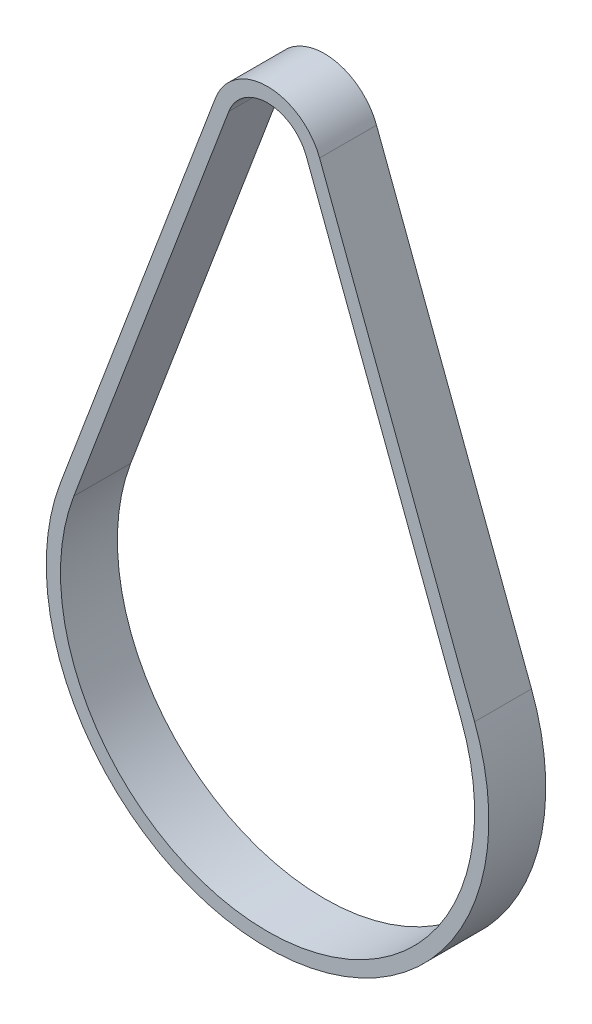
ISO-10303-21;
HEADER;
FILE_DESCRIPTION(('STEP AP214'),'2;1');
FILE_NAME('part.step','',(''),(''),'','','');
FILE_SCHEMA(('AUTOMOTIVE_DESIGN { 1 0 10303 214 1 1 1 1 }'));
ENDSEC;
DATA;
#1=APPLICATION_CONTEXT('core data for automotive mechanical design processes');
#2=APPLICATION_PROTOCOL_DEFINITION('international standard','automotive_design',2000,#1);
#3=PRODUCT_CONTEXT('',#1,'mechanical');
#4=PRODUCT('Part','Part','',(#3));
#5=PRODUCT_RELATED_PRODUCT_CATEGORY('part','',(#4));
#6=PRODUCT_DEFINITION_FORMATION('','',#4);
#7=PRODUCT_DEFINITION_CONTEXT('part definition',#1,'design');
#8=PRODUCT_DEFINITION('design','',#6,#7);
#9=PRODUCT_DEFINITION_SHAPE('','',#8);
#10=(LENGTH_UNIT() NAMED_UNIT(*) SI_UNIT(.MILLI.,.METRE.));
#11=(NAMED_UNIT(*) PLANE_ANGLE_UNIT() SI_UNIT($,.RADIAN.));
#12=(NAMED_UNIT(*) SI_UNIT($,.STERADIAN.) SOLID_ANGLE_UNIT());
#13=UNCERTAINTY_MEASURE_WITH_UNIT(LENGTH_MEASURE(1.E-05),#10,'distance_accuracy_value','');
#14=(GEOMETRIC_REPRESENTATION_CONTEXT(3) GLOBAL_UNCERTAINTY_ASSIGNED_CONTEXT((#13)) GLOBAL_UNIT_ASSIGNED_CONTEXT((#10,
#11,#12)) REPRESENTATION_CONTEXT('',''));
#15=CARTESIAN_POINT('',(0.,0.,0.));
#16=DIRECTION('',(0.,0.,1.));
#17=DIRECTION('',(1.,0.,0.));
#18=AXIS2_PLACEMENT_3D('',#15,#16,#17);
#19=CARTESIAN_POINT('',(0.,26.8063948233017,8.));
#20=DIRECTION('',(0.,0.,1.));
#21=DIRECTION('',(1.,0.,0.));
#22=AXIS2_PLACEMENT_3D('',#19,#20,#21);
#23=PLANE('',#22);
#24=CARTESIAN_POINT('',(0.,26.8063948233017,8.));
#25=DIRECTION('',(0.,0.,1.));
#26=DIRECTION('',(1.,0.,0.));
#27=AXIS2_PLACEMENT_3D('',#24,#25,#26);
#28=CIRCLE('',#27,7.81999999999999);
#29=CARTESIAN_POINT('',(7.31628348817592,29.5676256938818,8.));
#30=VERTEX_POINT('',#29);
#31=CARTESIAN_POINT('',(-7.31628348817593,29.5676256938818,8.));
#32=VERTEX_POINT('',#31);
#33=EDGE_CURVE('E133',#30,#32,#28,.T.);
#34=ORIENTED_EDGE('',*,*,#33,.T.);
#35=DIRECTION('',(-0.353098576800516,-0.935586123807664,0.));
#36=VECTOR('',#35,1.);
#37=CARTESIAN_POINT('',(-7.31628348817593,29.5676256938818,8.));
#38=LINE('',#37,#36);
#39=CARTESIAN_POINT('',(-29.1014063810374,-28.1552313866797,8.));
#40=VERTEX_POINT('',#39);
#41=EDGE_CURVE('E136',#32,#40,#38,.T.);
#42=ORIENTED_EDGE('',*,*,#41,.T.);
#43=CARTESIAN_POINT('',(0.,-39.1383626180598,8.));
#44=DIRECTION('',(0.,0.,1.));
#45=DIRECTION('',(1.,0.,0.));
#46=AXIS2_PLACEMENT_3D('',#43,#44,#45);
#47=CIRCLE('',#46,31.105);
#48=CARTESIAN_POINT('',(29.1014063810374,-28.1552313866797,8.));
#49=VERTEX_POINT('',#48);
#50=EDGE_CURVE('E139',#40,#49,#47,.T.);
#51=ORIENTED_EDGE('',*,*,#50,.T.);
#52=DIRECTION('',(-0.353098576800516,0.935586123807664,0.));
#53=VECTOR('',#52,1.);
#54=CARTESIAN_POINT('',(7.31628348817592,29.5676256938818,8.));
#55=LINE('',#54,#53);
#56=EDGE_CURVE('E141',#49,#30,#55,.T.);
#57=ORIENTED_EDGE('',*,*,#56,.T.);
#58=EDGE_LOOP('',(#34,#42,#51,#57));
#59=FACE_BOUND('',#58,.T.);
#60=DIRECTION('',(-0.353098576800516,0.935586123807664,0.));
#61=VECTOR('',#60,1.);
#62=CARTESIAN_POINT('',(5.4451112405606,28.8614285402807,8.));
#63=LINE('',#62,#61);
#64=CARTESIAN_POINT('',(27.2302341334221,-28.8614285402807,8.));
#65=VERTEX_POINT('',#64);
#66=CARTESIAN_POINT('',(5.4451112405606,28.8614285402807,8.));
#67=VERTEX_POINT('',#66);
#68=EDGE_CURVE('E105',#65,#67,#63,.T.);
#69=ORIENTED_EDGE('',*,*,#68,.F.);
#70=CARTESIAN_POINT('',(0.,-39.1383626180598,8.));
#71=DIRECTION('',(0.,0.,1.));
#72=DIRECTION('',(1.,0.,0.));
#73=AXIS2_PLACEMENT_3D('',#70,#71,#72);
#74=CIRCLE('',#73,29.105);
#75=CARTESIAN_POINT('',(-27.2302341334221,-28.8614285402807,8.));
#76=VERTEX_POINT('',#75);
#77=EDGE_CURVE('E97',#76,#65,#74,.T.);
#78=ORIENTED_EDGE('',*,*,#77,.F.);
#79=DIRECTION('',(-0.353098576800516,-0.935586123807664,0.));
#80=VECTOR('',#79,1.);
#81=CARTESIAN_POINT('',(-5.44511124056061,28.8614285402807,8.));
#82=LINE('',#81,#80);
#83=CARTESIAN_POINT('',(-5.44511124056061,28.8614285402807,8.));
#84=VERTEX_POINT('',#83);
#85=EDGE_CURVE('E119',#84,#76,#82,.T.);
#86=ORIENTED_EDGE('',*,*,#85,.F.);
#87=CARTESIAN_POINT('',(0.,26.8063948233017,8.));
#88=DIRECTION('',(0.,0.,1.));
#89=DIRECTION('',(1.,0.,0.));
#90=AXIS2_PLACEMENT_3D('',#87,#88,#89);
#91=CIRCLE('',#90,5.81999999999999);
#92=EDGE_CURVE('E117',#67,#84,#91,.T.);
#93=ORIENTED_EDGE('',*,*,#92,.F.);
#94=EDGE_LOOP('',(#69,#78,#86,#93));
#95=FACE_BOUND('',#94,.T.);
#96=ADVANCED_FACE('F32',(#59,#95),#23,.T.);
#97=CARTESIAN_POINT('',(0.,26.8063948233017,0.));
#98=DIRECTION('',(0.,0.,1.));
#99=DIRECTION('',(1.,0.,0.));
#100=AXIS2_PLACEMENT_3D('',#97,#98,#99);
#101=PLANE('',#100);
#102=CARTESIAN_POINT('',(0.,26.8063948233017,0.));
#103=DIRECTION('',(0.,0.,1.));
#104=DIRECTION('',(1.,0.,0.));
#105=AXIS2_PLACEMENT_3D('',#102,#103,#104);
#106=CIRCLE('',#105,7.81999999999999);
#107=CARTESIAN_POINT('',(7.31628348817592,29.5676256938818,0.));
#108=VERTEX_POINT('',#107);
#109=CARTESIAN_POINT('',(-7.31628348817593,29.5676256938818,0.));
#110=VERTEX_POINT('',#109);
#111=EDGE_CURVE('E113',#108,#110,#106,.T.);
#112=ORIENTED_EDGE('',*,*,#111,.F.);
#113=DIRECTION('',(-0.353098576800516,0.935586123807664,0.));
#114=VECTOR('',#113,1.);
#115=CARTESIAN_POINT('',(7.31628348817592,29.5676256938818,0.));
#116=LINE('',#115,#114);
#117=CARTESIAN_POINT('',(29.1014063810374,-28.1552313866797,0.));
#118=VERTEX_POINT('',#117);
#119=EDGE_CURVE('E137',#118,#108,#116,.T.);
#120=ORIENTED_EDGE('',*,*,#119,.F.);
#121=CARTESIAN_POINT('',(0.,-39.1383626180598,0.));
#122=DIRECTION('',(0.,0.,1.));
#123=DIRECTION('',(1.,0.,0.));
#124=AXIS2_PLACEMENT_3D('',#121,#122,#123);
#125=CIRCLE('',#124,31.105);
#126=CARTESIAN_POINT('',(-29.1014063810374,-28.1552313866797,0.));
#127=VERTEX_POINT('',#126);
#128=EDGE_CURVE('E148',#127,#118,#125,.T.);
#129=ORIENTED_EDGE('',*,*,#128,.F.);
#130=DIRECTION('',(-0.353098576800516,-0.935586123807664,0.));
#131=VECTOR('',#130,1.);
#132=CARTESIAN_POINT('',(-7.31628348817593,29.5676256938818,0.));
#133=LINE('',#132,#131);
#134=EDGE_CURVE('E146',#110,#127,#133,.T.);
#135=ORIENTED_EDGE('',*,*,#134,.F.);
#136=EDGE_LOOP('',(#112,#120,#129,#135));
#137=FACE_BOUND('',#136,.T.);
#138=CARTESIAN_POINT('',(0.,-39.1383626180598,0.));
#139=DIRECTION('',(0.,0.,1.));
#140=DIRECTION('',(1.,0.,0.));
#141=AXIS2_PLACEMENT_3D('',#138,#139,#140);
#142=CIRCLE('',#141,29.105);
#143=CARTESIAN_POINT('',(-27.2302341334221,-28.8614285402807,0.));
#144=VERTEX_POINT('',#143);
#145=CARTESIAN_POINT('',(27.2302341334221,-28.8614285402807,0.));
#146=VERTEX_POINT('',#145);
#147=EDGE_CURVE('E55',#144,#146,#142,.T.);
#148=ORIENTED_EDGE('',*,*,#147,.T.);
#149=DIRECTION('',(-0.353098576800516,0.935586123807664,0.));
#150=VECTOR('',#149,1.);
#151=CARTESIAN_POINT('',(5.4451112405606,28.8614285402807,0.));
#152=LINE('',#151,#150);
#153=CARTESIAN_POINT('',(5.4451112405606,28.8614285402807,0.));
#154=VERTEX_POINT('',#153);
#155=EDGE_CURVE('E112',#146,#154,#152,.T.);
#156=ORIENTED_EDGE('',*,*,#155,.T.);
#157=CARTESIAN_POINT('',(0.,26.8063948233017,0.));
#158=DIRECTION('',(0.,0.,1.));
#159=DIRECTION('',(1.,0.,0.));
#160=AXIS2_PLACEMENT_3D('',#157,#158,#159);
#161=CIRCLE('',#160,5.81999999999999);
#162=CARTESIAN_POINT('',(-5.44511124056061,28.8614285402807,0.));
#163=VERTEX_POINT('',#162);
#164=EDGE_CURVE('E125',#154,#163,#161,.T.);
#165=ORIENTED_EDGE('',*,*,#164,.T.);
#166=DIRECTION('',(-0.353098576800516,-0.935586123807664,0.));
#167=VECTOR('',#166,1.);
#168=CARTESIAN_POINT('',(-5.44511124056061,28.8614285402807,0.));
#169=LINE('',#168,#167);
#170=EDGE_CURVE('E106',#163,#144,#169,.T.);
#171=ORIENTED_EDGE('',*,*,#170,.T.);
#172=EDGE_LOOP('',(#148,#156,#165,#171));
#173=FACE_BOUND('',#172,.T.);
#174=ADVANCED_FACE('F166',(#137,#173),#101,.F.);
#175=CARTESIAN_POINT('',(0.,26.8063948233017,8.));
#176=DIRECTION('',(0.,0.,-1.));
#177=DIRECTION('',(-1.,0.,0.));
#178=AXIS2_PLACEMENT_3D('',#175,#176,#177);
#179=CYLINDRICAL_SURFACE('',#178,7.81999999999999);
#180=ORIENTED_EDGE('',*,*,#111,.T.);
#181=DIRECTION('',(0.,0.,-1.));
#182=VECTOR('',#181,1.);
#183=CARTESIAN_POINT('',(-7.31628348817593,29.5676256938818,8.));
#184=LINE('',#183,#182);
#185=EDGE_CURVE('E11',#32,#110,#184,.T.);
#186=ORIENTED_EDGE('',*,*,#185,.F.);
#187=ORIENTED_EDGE('',*,*,#33,.F.);
#188=DIRECTION('',(0.,0.,-1.));
#189=VECTOR('',#188,1.);
#190=CARTESIAN_POINT('',(7.31628348817592,29.5676256938818,8.));
#191=LINE('',#190,#189);
#192=EDGE_CURVE('E143',#30,#108,#191,.T.);
#193=ORIENTED_EDGE('',*,*,#192,.T.);
#194=EDGE_LOOP('',(#180,#186,#187,#193));
#195=FACE_BOUND('',#194,.T.);
#196=ADVANCED_FACE('F34',(#195),#179,.T.);
#197=CARTESIAN_POINT('',(-7.31628348817593,29.5676256938818,8.));
#198=DIRECTION('',(0.935586123807664,-0.353098576800517,0.));
#199=DIRECTION('',(0.353098576800517,0.935586123807664,0.));
#200=AXIS2_PLACEMENT_3D('',#197,#198,#199);
#201=PLANE('',#200);
#202=ORIENTED_EDGE('',*,*,#134,.T.);
#203=DIRECTION('',(0.,0.,-1.));
#204=VECTOR('',#203,1.);
#205=CARTESIAN_POINT('',(-29.1014063810374,-28.1552313866797,8.));
#206=LINE('',#205,#204);
#207=EDGE_CURVE('E40',#40,#127,#206,.T.);
#208=ORIENTED_EDGE('',*,*,#207,.F.);
#209=ORIENTED_EDGE('',*,*,#41,.F.);
#210=ORIENTED_EDGE('',*,*,#185,.T.);
#211=EDGE_LOOP('',(#202,#208,#209,#210));
#212=FACE_BOUND('',#211,.T.);
#213=ADVANCED_FACE('F176',(#212),#201,.F.);
#214=CARTESIAN_POINT('',(0.,-39.1383626180598,8.));
#215=DIRECTION('',(0.,0.,-1.));
#216=DIRECTION('',(-1.,0.,0.));
#217=AXIS2_PLACEMENT_3D('',#214,#215,#216);
#218=CYLINDRICAL_SURFACE('',#217,31.105);
#219=ORIENTED_EDGE('',*,*,#128,.T.);
#220=DIRECTION('',(0.,0.,-1.));
#221=VECTOR('',#220,1.);
#222=CARTESIAN_POINT('',(29.1014063810374,-28.1552313866797,8.));
#223=LINE('',#222,#221);
#224=EDGE_CURVE('E153',#49,#118,#223,.T.);
#225=ORIENTED_EDGE('',*,*,#224,.F.);
#226=ORIENTED_EDGE('',*,*,#50,.F.);
#227=ORIENTED_EDGE('',*,*,#207,.T.);
#228=EDGE_LOOP('',(#219,#225,#226,#227));
#229=FACE_BOUND('',#228,.T.);
#230=ADVANCED_FACE('F160',(#229),#218,.T.);
#231=CARTESIAN_POINT('',(7.31628348817592,29.5676256938818,8.));
#232=DIRECTION('',(-0.935586123807664,-0.353098576800516,0.));
#233=DIRECTION('',(0.353098576800516,-0.935586123807664,0.));
#234=AXIS2_PLACEMENT_3D('',#231,#232,#233);
#235=PLANE('',#234);
#236=ORIENTED_EDGE('',*,*,#119,.T.);
#237=ORIENTED_EDGE('',*,*,#192,.F.);
#238=ORIENTED_EDGE('',*,*,#56,.F.);
#239=ORIENTED_EDGE('',*,*,#224,.T.);
#240=EDGE_LOOP('',(#236,#237,#238,#239));
#241=FACE_BOUND('',#240,.T.);
#242=ADVANCED_FACE('F170',(#241),#235,.F.);
#243=CARTESIAN_POINT('',(0.,-39.1383626180598,8.));
#244=DIRECTION('',(0.,0.,-1.));
#245=DIRECTION('',(-1.,0.,0.));
#246=AXIS2_PLACEMENT_3D('',#243,#244,#245);
#247=CYLINDRICAL_SURFACE('',#246,29.105);
#248=ORIENTED_EDGE('',*,*,#147,.F.);
#249=DIRECTION('',(0.,0.,-1.));
#250=VECTOR('',#249,1.);
#251=CARTESIAN_POINT('',(-27.2302341334221,-28.8614285402807,8.));
#252=LINE('',#251,#250);
#253=EDGE_CURVE('E101',#76,#144,#252,.T.);
#254=ORIENTED_EDGE('',*,*,#253,.F.);
#255=ORIENTED_EDGE('',*,*,#77,.T.);
#256=DIRECTION('',(0.,0.,-1.));
#257=VECTOR('',#256,1.);
#258=CARTESIAN_POINT('',(27.2302341334221,-28.8614285402807,8.));
#259=LINE('',#258,#257);
#260=EDGE_CURVE('E100',#65,#146,#259,.T.);
#261=ORIENTED_EDGE('',*,*,#260,.T.);
#262=EDGE_LOOP('',(#248,#254,#255,#261));
#263=FACE_BOUND('',#262,.T.);
#264=ADVANCED_FACE('F99',(#263),#247,.F.);
#265=CARTESIAN_POINT('',(5.4451112405606,28.8614285402807,8.));
#266=DIRECTION('',(-0.935586123807664,-0.353098576800516,0.));
#267=DIRECTION('',(0.353098576800516,-0.935586123807664,0.));
#268=AXIS2_PLACEMENT_3D('',#265,#266,#267);
#269=PLANE('',#268);
#270=ORIENTED_EDGE('',*,*,#155,.F.);
#271=ORIENTED_EDGE('',*,*,#260,.F.);
#272=ORIENTED_EDGE('',*,*,#68,.T.);
#273=DIRECTION('',(0.,0.,-1.));
#274=VECTOR('',#273,1.);
#275=CARTESIAN_POINT('',(5.4451112405606,28.8614285402807,8.));
#276=LINE('',#275,#274);
#277=EDGE_CURVE('E114',#67,#154,#276,.T.);
#278=ORIENTED_EDGE('',*,*,#277,.T.);
#279=EDGE_LOOP('',(#270,#271,#272,#278));
#280=FACE_BOUND('',#279,.T.);
#281=ADVANCED_FACE('F109',(#280),#269,.T.);
#282=CARTESIAN_POINT('',(0.,26.8063948233017,8.));
#283=DIRECTION('',(0.,0.,-1.));
#284=DIRECTION('',(-1.,0.,0.));
#285=AXIS2_PLACEMENT_3D('',#282,#283,#284);
#286=CYLINDRICAL_SURFACE('',#285,5.81999999999999);
#287=ORIENTED_EDGE('',*,*,#164,.F.);
#288=ORIENTED_EDGE('',*,*,#277,.F.);
#289=ORIENTED_EDGE('',*,*,#92,.T.);
#290=DIRECTION('',(0.,0.,-1.));
#291=VECTOR('',#290,1.);
#292=CARTESIAN_POINT('',(-5.44511124056061,28.8614285402807,8.));
#293=LINE('',#292,#291);
#294=EDGE_CURVE('E47',#84,#163,#293,.T.);
#295=ORIENTED_EDGE('',*,*,#294,.T.);
#296=EDGE_LOOP('',(#287,#288,#289,#295));
#297=FACE_BOUND('',#296,.T.);
#298=ADVANCED_FACE('F199',(#297),#286,.F.);
#299=CARTESIAN_POINT('',(-5.44511124056061,28.8614285402807,8.));
#300=DIRECTION('',(0.935586123807664,-0.353098576800517,0.));
#301=DIRECTION('',(0.353098576800517,0.935586123807664,0.));
#302=AXIS2_PLACEMENT_3D('',#299,#300,#301);
#303=PLANE('',#302);
#304=ORIENTED_EDGE('',*,*,#170,.F.);
#305=ORIENTED_EDGE('',*,*,#294,.F.);
#306=ORIENTED_EDGE('',*,*,#85,.T.);
#307=ORIENTED_EDGE('',*,*,#253,.T.);
#308=EDGE_LOOP('',(#304,#305,#306,#307));
#309=FACE_BOUND('',#308,.T.);
#310=ADVANCED_FACE('F203',(#309),#303,.T.);
#311=CLOSED_SHELL('',(#96,#174,#196,#213,#230,#242,#264,#281,#298,#310));
#312=MANIFOLD_SOLID_BREP('B2',#311);
#313=ADVANCED_BREP_SHAPE_REPRESENTATION('',(#18,#312),#14);
#314=SHAPE_DEFINITION_REPRESENTATION(#9,#313);
ENDSEC;
END-ISO-10303-21;
